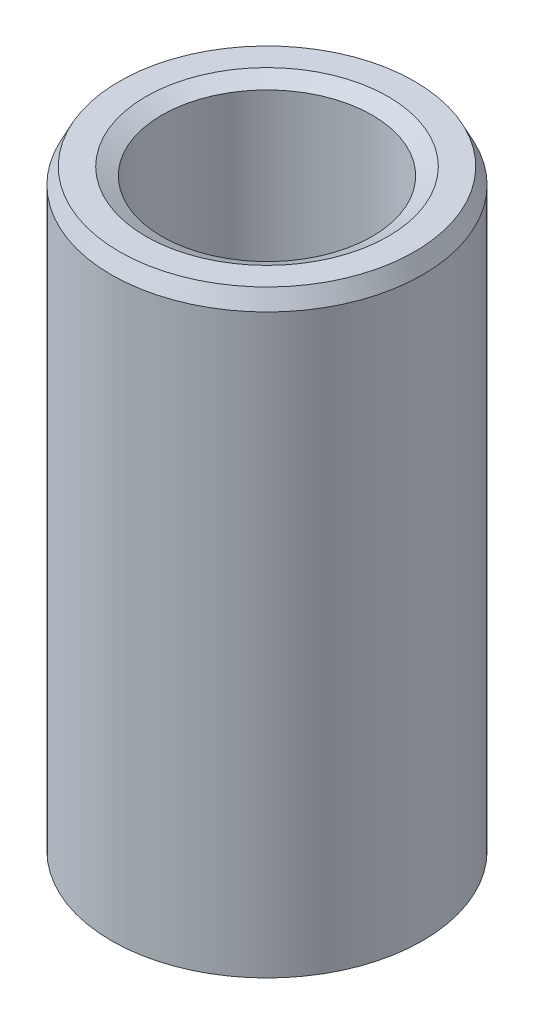
ISO-10303-21;
HEADER;
FILE_DESCRIPTION(('STEP AP214'),'2;1');
FILE_NAME('part.step','',(''),(''),'','','');
FILE_SCHEMA(('AUTOMOTIVE_DESIGN { 1 0 10303 214 1 1 1 1 }'));
ENDSEC;
DATA;
#1=APPLICATION_CONTEXT('core data for automotive mechanical design processes');
#2=APPLICATION_PROTOCOL_DEFINITION('international standard','automotive_design',2000,#1);
#3=PRODUCT_CONTEXT('',#1,'mechanical');
#4=PRODUCT('Part','Part','',(#3));
#5=PRODUCT_RELATED_PRODUCT_CATEGORY('part','',(#4));
#6=PRODUCT_DEFINITION_FORMATION('','',#4);
#7=PRODUCT_DEFINITION_CONTEXT('part definition',#1,'design');
#8=PRODUCT_DEFINITION('design','',#6,#7);
#9=PRODUCT_DEFINITION_SHAPE('','',#8);
#10=(LENGTH_UNIT() NAMED_UNIT(*) SI_UNIT(.MILLI.,.METRE.));
#11=(NAMED_UNIT(*) PLANE_ANGLE_UNIT() SI_UNIT($,.RADIAN.));
#12=(NAMED_UNIT(*) SI_UNIT($,.STERADIAN.) SOLID_ANGLE_UNIT());
#13=UNCERTAINTY_MEASURE_WITH_UNIT(LENGTH_MEASURE(1.E-05),#10,'distance_accuracy_value','');
#14=(GEOMETRIC_REPRESENTATION_CONTEXT(3) GLOBAL_UNCERTAINTY_ASSIGNED_CONTEXT((#13)) GLOBAL_UNIT_ASSIGNED_CONTEXT((#10,
#11,#12)) REPRESENTATION_CONTEXT('',''));
#15=CARTESIAN_POINT('',(0.,0.,0.));
#16=DIRECTION('',(0.,0.,1.));
#17=DIRECTION('',(1.,0.,0.));
#18=AXIS2_PLACEMENT_3D('',#15,#16,#17);
#19=CARTESIAN_POINT('',(0.,57.9000556438181,0.));
#20=DIRECTION('',(0.,-1.,0.));
#21=DIRECTION('',(0.,0.,-1.));
#22=AXIS2_PLACEMENT_3D('',#19,#20,#21);
#23=CYLINDRICAL_SURFACE('',#22,15.);
#24=CARTESIAN_POINT('',(0.,0.773980148250163,0.));
#25=DIRECTION('',(0.,1.,0.));
#26=DIRECTION('',(0.,0.,1.));
#27=AXIS2_PLACEMENT_3D('',#24,#25,#26);
#28=CIRCLE('',#27,15.);
#29=CARTESIAN_POINT('',(0.,0.773980148250163,-15.));
#30=VERTEX_POINT('',#29);
#31=EDGE_CURVE('E10',#30,#30,#28,.T.);
#32=CARTESIAN_POINT('',(0.,56.3586932882017,0.));
#33=DIRECTION('',(0.,1.,0.));
#34=DIRECTION('',(0.,0.,1.));
#35=AXIS2_PLACEMENT_3D('',#32,#33,#34);
#36=CIRCLE('',#35,15.);
#37=CARTESIAN_POINT('',(0.,56.3586932882017,-15.));
#38=VERTEX_POINT('',#37);
#39=EDGE_CURVE('E50',#38,#38,#36,.F.);
#40=CARTESIAN_POINT('',(0.,0.773980148250163,-15.));
#41=CARTESIAN_POINT('',(0.,1.35298757679132,-15.));
#42=CARTESIAN_POINT('',(0.,1.93199500533249,-15.));
#43=CARTESIAN_POINT('',(0.,3.09000986241481,-15.));
#44=CARTESIAN_POINT('',(0.,3.66901729095597,-15.));
#45=CARTESIAN_POINT('',(0.,4.82703214803829,-15.));
#46=CARTESIAN_POINT('',(0.,5.40603957657946,-15.));
#47=CARTESIAN_POINT('',(0.,6.56405443366178,-15.));
#48=CARTESIAN_POINT('',(0.,7.14306186220294,-15.));
#49=CARTESIAN_POINT('',(0.,8.30107671928527,-15.));
#50=CARTESIAN_POINT('',(0.,8.88008414782643,-15.));
#51=CARTESIAN_POINT('',(0.,10.0380990049087,-15.));
#52=CARTESIAN_POINT('',(0.,10.6171064334499,-15.));
#53=CARTESIAN_POINT('',(0.,11.7751212905322,-15.));
#54=CARTESIAN_POINT('',(0.,12.3541287190734,-15.));
#55=CARTESIAN_POINT('',(0.,13.5121435761557,-15.));
#56=CARTESIAN_POINT('',(0.,14.0911510046969,-15.));
#57=CARTESIAN_POINT('',(0.,15.2491658617792,-15.));
#58=CARTESIAN_POINT('',(0.,15.8281732903204,-15.));
#59=CARTESIAN_POINT('',(0.,16.9861881474027,-15.));
#60=CARTESIAN_POINT('',(0.,17.5651955759439,-15.));
#61=CARTESIAN_POINT('',(0.,18.7232104330262,-15.));
#62=CARTESIAN_POINT('',(0.,19.3022178615673,-15.));
#63=CARTESIAN_POINT('',(0.,20.4602327186497,-15.));
#64=CARTESIAN_POINT('',(0.,21.0392401471908,-15.));
#65=CARTESIAN_POINT('',(0.,22.1972550042732,-15.));
#66=CARTESIAN_POINT('',(0.,22.7762624328143,-15.));
#67=CARTESIAN_POINT('',(0.,23.9342772898966,-15.));
#68=CARTESIAN_POINT('',(0.,24.5132847184378,-15.));
#69=CARTESIAN_POINT('',(0.,25.6712995755201,-15.));
#70=CARTESIAN_POINT('',(0.,26.2503070040613,-15.));
#71=CARTESIAN_POINT('',(0.,27.4083218611436,-15.));
#72=CARTESIAN_POINT('',(0.,27.9873292896848,-15.));
#73=CARTESIAN_POINT('',(0.,29.1453441467671,-15.));
#74=CARTESIAN_POINT('',(0.,29.7243515753083,-15.));
#75=CARTESIAN_POINT('',(0.,30.8823664323906,-15.));
#76=CARTESIAN_POINT('',(0.,31.4613738609317,-15.));
#77=CARTESIAN_POINT('',(0.,32.6193887180141,-15.));
#78=CARTESIAN_POINT('',(0.,33.1983961465552,-15.));
#79=CARTESIAN_POINT('',(0.,34.3564110036375,-15.));
#80=CARTESIAN_POINT('',(0.,34.9354184321787,-15.));
#81=CARTESIAN_POINT('',(0.,36.093433289261,-15.));
#82=CARTESIAN_POINT('',(0.,36.6724407178022,-15.));
#83=CARTESIAN_POINT('',(0.,37.8304555748845,-15.));
#84=CARTESIAN_POINT('',(0.,38.4094630034257,-15.));
#85=CARTESIAN_POINT('',(0.,39.567477860508,-15.));
#86=CARTESIAN_POINT('',(0.,40.1464852890492,-15.));
#87=CARTESIAN_POINT('',(0.,41.3045001461315,-15.));
#88=CARTESIAN_POINT('',(0.,41.8835075746726,-15.));
#89=CARTESIAN_POINT('',(0.,43.041522431755,-15.));
#90=CARTESIAN_POINT('',(0.,43.6205298602961,-15.));
#91=CARTESIAN_POINT('',(0.,44.7785447173785,-15.));
#92=CARTESIAN_POINT('',(0.,45.3575521459196,-15.));
#93=CARTESIAN_POINT('',(0.,46.5155670030019,-15.));
#94=CARTESIAN_POINT('',(0.,47.0945744315431,-15.));
#95=CARTESIAN_POINT('',(0.,48.2525892886254,-15.));
#96=CARTESIAN_POINT('',(0.,48.8315967171666,-15.));
#97=CARTESIAN_POINT('',(0.,49.9896115742489,-15.));
#98=CARTESIAN_POINT('',(0.,50.5686190027901,-15.));
#99=CARTESIAN_POINT('',(0.,51.7266338598724,-15.));
#100=CARTESIAN_POINT('',(0.,52.3056412884136,-15.));
#101=CARTESIAN_POINT('',(0.,53.4636561454959,-15.));
#102=CARTESIAN_POINT('',(0.,54.0426635740371,-15.));
#103=CARTESIAN_POINT('',(0.,55.2006784311194,-15.));
#104=CARTESIAN_POINT('',(0.,55.7796858596605,-15.));
#105=CARTESIAN_POINT('',(0.,56.3586932882017,-15.));
#106=B_SPLINE_CURVE_WITH_KNOTS('',3,(#40,#41,#42,#43,#44,#45,#46,#47,#48,#49,#50,#51,#52,#53,
#54,#55,#56,#57,#58,#59,#60,#61,#62,#63,#64,#65,#66,#67,#68,#69,#70,#71,#72,#73,#74,#75,#76,#77,
#78,#79,#80,#81,#82,#83,#84,#85,#86,#87,#88,#89,#90,#91,#92,#93,#94,#95,#96,#97,#98,#99,#100,
#101,#102,#103,#104,#105),.UNSPECIFIED.,.F.,.F.,(4,2,2,2,2,2,2,2,2,2,2,2,2,2,2,2,2,2,2,2,2,2,2,
2,2,2,2,2,2,2,2,2,4),(0.,1.73702228562349,3.47404457124697,5.21106685687046,6.94808914249395,
8.68511142811743,10.4221337137409,12.1591559993644,13.8961782849879,15.6332005706114,
17.3702228562349,19.1072451418583,20.8442674274818,22.5812897131053,24.3183119987288,
26.0553342843523,27.7923565699758,29.5293788555993,31.2664011412227,33.0034234268462,
34.7404457124697,36.4774679980932,38.2144902837167,39.9515125693402,41.6885348549636,
43.4255571405871,45.1625794262106,46.8996017118341,48.6366239974576,50.3736462830811,
52.1106685687046,53.8476908543281,55.5847131399515),.UNSPECIFIED.);
#107=EDGE_CURVE('BSEAM39',#30,#38,#106,.T.);
#108=ORIENTED_EDGE('',*,*,#31,.T.);
#109=ORIENTED_EDGE('',*,*,#39,.T.);
#110=ORIENTED_EDGE('',*,*,#107,.T.);
#111=ORIENTED_EDGE('',*,*,#107,.F.);
#112=EDGE_LOOP('',(#108,#110,#109,#111));
#113=FACE_BOUND('',#112,.T.);
#114=ADVANCED_FACE('F39',(#113),#23,.T.);
#115=CARTESIAN_POINT('',(0.,57.9000556438181,0.));
#116=DIRECTION('',(0.,1.,0.));
#117=DIRECTION('',(0.,0.,1.));
#118=AXIS2_PLACEMENT_3D('',#115,#116,#117);
#119=PLANE('',#118);
#120=CARTESIAN_POINT('',(0.,57.9000556438181,0.));
#121=DIRECTION('',(0.,1.,0.));
#122=DIRECTION('',(0.,0.,1.));
#123=AXIS2_PLACEMENT_3D('',#120,#121,#122);
#124=CIRCLE('',#123,11.6763154670359);
#125=CARTESIAN_POINT('',(0.,57.9000556438181,11.6763154670359));
#126=VERTEX_POINT('',#125);
#127=EDGE_CURVE('E58',#126,#126,#124,.F.);
#128=ORIENTED_EDGE('',*,*,#127,.T.);
#129=EDGE_LOOP('',(#128));
#130=FACE_BOUND('',#129,.T.);
#131=CARTESIAN_POINT('',(0.,57.9000556438181,0.));
#132=DIRECTION('',(0.,1.,0.));
#133=DIRECTION('',(0.,0.,1.));
#134=AXIS2_PLACEMENT_3D('',#131,#132,#133);
#135=CIRCLE('',#134,14.2260198517499);
#136=CARTESIAN_POINT('',(0.,57.9000556438181,-14.2260198517499));
#137=VERTEX_POINT('',#136);
#138=EDGE_CURVE('E61',#137,#137,#135,.T.);
#139=ORIENTED_EDGE('',*,*,#138,.T.);
#140=EDGE_LOOP('',(#139));
#141=FACE_BOUND('',#140,.T.);
#142=ADVANCED_FACE('F88',(#130,#141),#119,.T.);
#143=CARTESIAN_POINT('',(0.,0.,0.));
#144=DIRECTION('',(0.,1.,0.));
#145=DIRECTION('',(0.,0.,1.));
#146=AXIS2_PLACEMENT_3D('',#143,#144,#145);
#147=PLANE('',#146);
#148=CARTESIAN_POINT('',(0.,0.,0.));
#149=DIRECTION('',(0.,1.,0.));
#150=DIRECTION('',(0.,0.,1.));
#151=AXIS2_PLACEMENT_3D('',#148,#149,#150);
#152=CIRCLE('',#151,10.9089332596696);
#153=CARTESIAN_POINT('',(0.,0.,10.9089332596696));
#154=VERTEX_POINT('',#153);
#155=EDGE_CURVE('E51',#154,#154,#152,.T.);
#156=ORIENTED_EDGE('',*,*,#155,.T.);
#157=EDGE_LOOP('',(#156));
#158=FACE_BOUND('',#157,.T.);
#159=CARTESIAN_POINT('',(0.,0.,0.));
#160=DIRECTION('',(0.,1.,0.));
#161=DIRECTION('',(0.,0.,1.));
#162=AXIS2_PLACEMENT_3D('',#159,#160,#161);
#163=CIRCLE('',#162,13.4586376443836);
#164=CARTESIAN_POINT('',(0.,0.,13.4586376443836));
#165=VERTEX_POINT('',#164);
#166=EDGE_CURVE('E54',#165,#165,#163,.F.);
#167=ORIENTED_EDGE('',*,*,#166,.T.);
#168=EDGE_LOOP('',(#167));
#169=FACE_BOUND('',#168,.T.);
#170=ADVANCED_FACE('F83',(#158,#169),#147,.F.);
#171=CARTESIAN_POINT('',(0.,57.9000556438181,0.));
#172=DIRECTION('',(0.,-1.,0.));
#173=DIRECTION('',(0.,0.,-1.));
#174=AXIS2_PLACEMENT_3D('',#171,#172,#173);
#175=CYLINDRICAL_SURFACE('',#174,10.1349531114194);
#176=CARTESIAN_POINT('',(0.,57.1260754955679,0.));
#177=DIRECTION('',(0.,1.,0.));
#178=DIRECTION('',(0.,0.,1.));
#179=AXIS2_PLACEMENT_3D('',#176,#177,#178);
#180=CIRCLE('',#179,10.1349531114194);
#181=CARTESIAN_POINT('',(0.,57.1260754955679,-10.1349531114194));
#182=VERTEX_POINT('',#181);
#183=EDGE_CURVE('E67',#182,#182,#180,.T.);
#184=CARTESIAN_POINT('',(0.,1.54136235561642,0.));
#185=DIRECTION('',(0.,1.,0.));
#186=DIRECTION('',(0.,0.,1.));
#187=AXIS2_PLACEMENT_3D('',#184,#185,#186);
#188=CIRCLE('',#187,10.1349531114194);
#189=CARTESIAN_POINT('',(0.,1.54136235561641,-10.1349531114194));
#190=VERTEX_POINT('',#189);
#191=EDGE_CURVE('E69',#190,#190,#188,.F.);
#192=CARTESIAN_POINT('',(0.,57.1260754955679,-10.1349531114194));
#193=CARTESIAN_POINT('',(0.,56.5470680670268,-10.1349531114194));
#194=CARTESIAN_POINT('',(0.,55.9680606384856,-10.1349531114194));
#195=CARTESIAN_POINT('',(0.,54.8100457814033,-10.1349531114194));
#196=CARTESIAN_POINT('',(0.,54.2310383528621,-10.1349531114194));
#197=CARTESIAN_POINT('',(0.,53.0730234957798,-10.1349531114194));
#198=CARTESIAN_POINT('',(0.,52.4940160672386,-10.1349531114194));
#199=CARTESIAN_POINT('',(0.,51.3360012101563,-10.1349531114194));
#200=CARTESIAN_POINT('',(0.,50.7569937816151,-10.1349531114194));
#201=CARTESIAN_POINT('',(0.,49.5989789245328,-10.1349531114194));
#202=CARTESIAN_POINT('',(0.,49.0199714959917,-10.1349531114194));
#203=CARTESIAN_POINT('',(0.,47.8619566389093,-10.1349531114194));
#204=CARTESIAN_POINT('',(0.,47.2829492103682,-10.1349531114194));
#205=CARTESIAN_POINT('',(0.,46.1249343532859,-10.1349531114194));
#206=CARTESIAN_POINT('',(0.,45.5459269247447,-10.1349531114194));
#207=CARTESIAN_POINT('',(0.,44.3879120676624,-10.1349531114194));
#208=CARTESIAN_POINT('',(0.,43.8089046391212,-10.1349531114194));
#209=CARTESIAN_POINT('',(0.,42.6508897820389,-10.1349531114194));
#210=CARTESIAN_POINT('',(0.,42.0718823534977,-10.1349531114194));
#211=CARTESIAN_POINT('',(0.,40.9138674964154,-10.1349531114194));
#212=CARTESIAN_POINT('',(0.,40.3348600678742,-10.1349531114194));
#213=CARTESIAN_POINT('',(0.,39.1768452107919,-10.1349531114194));
#214=CARTESIAN_POINT('',(0.,38.5978377822507,-10.1349531114194));
#215=CARTESIAN_POINT('',(0.,37.4398229251684,-10.1349531114194));
#216=CARTESIAN_POINT('',(0.,36.8608154966273,-10.1349531114194));
#217=CARTESIAN_POINT('',(0.,35.7028006395449,-10.1349531114194));
#218=CARTESIAN_POINT('',(0.,35.1237932110038,-10.1349531114194));
#219=CARTESIAN_POINT('',(0.,33.9657783539215,-10.1349531114194));
#220=CARTESIAN_POINT('',(0.,33.3867709253803,-10.1349531114194));
#221=CARTESIAN_POINT('',(0.,32.228756068298,-10.1349531114194));
#222=CARTESIAN_POINT('',(0.,31.6497486397568,-10.1349531114194));
#223=CARTESIAN_POINT('',(0.,30.4917337826745,-10.1349531114194));
#224=CARTESIAN_POINT('',(0.,29.9127263541333,-10.1349531114194));
#225=CARTESIAN_POINT('',(0.,28.754711497051,-10.1349531114194));
#226=CARTESIAN_POINT('',(0.,28.1757040685098,-10.1349531114194));
#227=CARTESIAN_POINT('',(0.,27.0176892114275,-10.1349531114194));
#228=CARTESIAN_POINT('',(0.,26.4386817828864,-10.1349531114194));
#229=CARTESIAN_POINT('',(0.,25.280666925804,-10.1349531114194));
#230=CARTESIAN_POINT('',(0.,24.7016594972629,-10.1349531114194));
#231=CARTESIAN_POINT('',(0.,23.5436446401806,-10.1349531114194));
#232=CARTESIAN_POINT('',(0.,22.9646372116394,-10.1349531114194));
#233=CARTESIAN_POINT('',(0.,21.8066223545571,-10.1349531114194));
#234=CARTESIAN_POINT('',(0.,21.2276149260159,-10.1349531114194));
#235=CARTESIAN_POINT('',(0.,20.0696000689336,-10.1349531114194));
#236=CARTESIAN_POINT('',(0.,19.4905926403924,-10.1349531114194));
#237=CARTESIAN_POINT('',(0.,18.3325777833101,-10.1349531114194));
#238=CARTESIAN_POINT('',(0.,17.7535703547689,-10.1349531114194));
#239=CARTESIAN_POINT('',(0.,16.5955554976866,-10.1349531114194));
#240=CARTESIAN_POINT('',(0.,16.0165480691454,-10.1349531114194));
#241=CARTESIAN_POINT('',(0.,14.8585332120631,-10.1349531114194));
#242=CARTESIAN_POINT('',(0.,14.279525783522,-10.1349531114194));
#243=CARTESIAN_POINT('',(0.,13.1215109264396,-10.1349531114194));
#244=CARTESIAN_POINT('',(0.,12.5425034978985,-10.1349531114194));
#245=CARTESIAN_POINT('',(0.,11.3844886408162,-10.1349531114194));
#246=CARTESIAN_POINT('',(0.,10.805481212275,-10.1349531114194));
#247=CARTESIAN_POINT('',(0.,9.64746635519267,-10.1349531114194));
#248=CARTESIAN_POINT('',(0.,9.06845892665151,-10.1349531114194));
#249=CARTESIAN_POINT('',(0.,7.91044406956919,-10.1349531114194));
#250=CARTESIAN_POINT('',(0.,7.33143664102803,-10.1349531114194));
#251=CARTESIAN_POINT('',(0.,6.17342178394571,-10.1349531114194));
#252=CARTESIAN_POINT('',(0.,5.59441435540455,-10.1349531114194));
#253=CARTESIAN_POINT('',(0.,4.43639949832222,-10.1349531114194));
#254=CARTESIAN_POINT('',(0.,3.85739206978106,-10.1349531114194));
#255=CARTESIAN_POINT('',(0.,2.69937721269873,-10.1349531114194));
#256=CARTESIAN_POINT('',(0.,2.12036978415757,-10.1349531114194));
#257=CARTESIAN_POINT('',(0.,1.54136235561641,-10.1349531114194));
#258=B_SPLINE_CURVE_WITH_KNOTS('',3,(#192,#193,#194,#195,#196,#197,#198,#199,#200,#201,#202,
#203,#204,#205,#206,#207,#208,#209,#210,#211,#212,#213,#214,#215,#216,#217,#218,#219,#220,#221,
#222,#223,#224,#225,#226,#227,#228,#229,#230,#231,#232,#233,#234,#235,#236,#237,#238,#239,#240,
#241,#242,#243,#244,#245,#246,#247,#248,#249,#250,#251,#252,#253,#254,#255,#256,#257),
.UNSPECIFIED.,.F.,.F.,(4,2,2,2,2,2,2,2,2,2,2,2,2,2,2,2,2,2,2,2,2,2,2,2,2,2,2,2,2,2,2,2,4),(0.,
1.73702228562349,3.47404457124697,5.21106685687046,6.94808914249395,8.68511142811743,
10.4221337137409,12.1591559993644,13.8961782849879,15.6332005706114,17.3702228562348,
19.1072451418583,20.8442674274818,22.5812897131053,24.3183119987288,26.0553342843523,
27.7923565699758,29.5293788555992,31.2664011412227,33.0034234268462,34.7404457124697,
36.4774679980932,38.2144902837167,39.9515125693402,41.6885348549636,43.4255571405871,
45.1625794262106,46.8996017118341,48.6366239974576,50.3736462830811,52.1106685687045,
53.847690854328,55.5847131399515),.UNSPECIFIED.);
#259=EDGE_CURVE('BSEAM71',#182,#190,#258,.T.);
#260=ORIENTED_EDGE('',*,*,#183,.T.);
#261=ORIENTED_EDGE('',*,*,#191,.T.);
#262=ORIENTED_EDGE('',*,*,#259,.T.);
#263=ORIENTED_EDGE('',*,*,#259,.F.);
#264=EDGE_LOOP('',(#260,#262,#261,#263));
#265=FACE_BOUND('',#264,.T.);
#266=ADVANCED_FACE('F71',(#265),#175,.F.);
#267=CARTESIAN_POINT('',(0.,57.1260754955679,0.));
#268=DIRECTION('',(0.,1.,0.));
#269=DIRECTION('',(0.,0.,1.));
#270=AXIS2_PLACEMENT_3D('',#267,#268,#269);
#271=CONICAL_SURFACE('',#270,10.1349531114194,1.10543794793032);
#272=ORIENTED_EDGE('',*,*,#127,.F.);
#273=EDGE_LOOP('',(#272));
#274=FACE_BOUND('',#273,.T.);
#275=ORIENTED_EDGE('',*,*,#183,.F.);
#276=EDGE_LOOP('',(#275));
#277=FACE_BOUND('',#276,.T.);
#278=ADVANCED_FACE('F77',(#274,#277),#271,.F.);
#279=CARTESIAN_POINT('',(0.,0.,0.));
#280=DIRECTION('',(0.,-1.,0.));
#281=DIRECTION('',(0.,0.,-1.));
#282=AXIS2_PLACEMENT_3D('',#279,#280,#281);
#283=CONICAL_SURFACE('',#282,10.9089332596696,0.465358378864579);
#284=ORIENTED_EDGE('',*,*,#191,.F.);
#285=EDGE_LOOP('',(#284));
#286=FACE_BOUND('',#285,.T.);
#287=ORIENTED_EDGE('',*,*,#155,.F.);
#288=EDGE_LOOP('',(#287));
#289=FACE_BOUND('',#288,.T.);
#290=ADVANCED_FACE('F73',(#286,#289),#283,.F.);
#291=CARTESIAN_POINT('',(0.,0.773980148250163,0.));
#292=DIRECTION('',(0.,1.,0.));
#293=DIRECTION('',(0.,0.,1.));
#294=AXIS2_PLACEMENT_3D('',#291,#292,#293);
#295=CONICAL_SURFACE('',#294,15.,1.10543794793032);
#296=ORIENTED_EDGE('',*,*,#166,.F.);
#297=EDGE_LOOP('',(#296));
#298=FACE_BOUND('',#297,.T.);
#299=ORIENTED_EDGE('',*,*,#31,.F.);
#300=EDGE_LOOP('',(#299));
#301=FACE_BOUND('',#300,.T.);
#302=ADVANCED_FACE('F76',(#298,#301),#295,.T.);
#303=CARTESIAN_POINT('',(0.,57.9000556438181,0.));
#304=DIRECTION('',(0.,-1.,0.));
#305=DIRECTION('',(0.,0.,-1.));
#306=AXIS2_PLACEMENT_3D('',#303,#304,#305);
#307=CONICAL_SURFACE('',#306,14.2260198517499,0.465358378864579);
#308=CARTESIAN_POINT('',(0.,56.3586932882017,-15.));
#309=CARTESIAN_POINT('',(0.,56.3747491460727,-14.9919377067891));
#310=CARTESIAN_POINT('',(0.,56.3908050039437,-14.9838754135781));
#311=CARTESIAN_POINT('',(0.,56.4229167196857,-14.9677508271562));
#312=CARTESIAN_POINT('',(0.,56.4389725775567,-14.9596885339453));
#313=CARTESIAN_POINT('',(0.,56.4710842932987,-14.9435639475234));
#314=CARTESIAN_POINT('',(0.,56.4871401511697,-14.9355016543125));
#315=CARTESIAN_POINT('',(0.,56.5192518669117,-14.9193770678906));
#316=CARTESIAN_POINT('',(0.,56.5353077247827,-14.9113147746797));
#317=CARTESIAN_POINT('',(0.,56.5674194405248,-14.8951901882578));
#318=CARTESIAN_POINT('',(0.,56.5834752983958,-14.8871278950469));
#319=CARTESIAN_POINT('',(0.,56.6155870141378,-14.871003308625));
#320=CARTESIAN_POINT('',(0.,56.6316428720088,-14.862941015414));
#321=CARTESIAN_POINT('',(0.,56.6637545877508,-14.8468164289922));
#322=CARTESIAN_POINT('',(0.,56.6798104456218,-14.8387541357812));
#323=CARTESIAN_POINT('',(0.,56.7119221613638,-14.8226295493593));
#324=CARTESIAN_POINT('',(0.,56.7279780192348,-14.8145672561484));
#325=CARTESIAN_POINT('',(0.,56.7600897349768,-14.7984426697265));
#326=CARTESIAN_POINT('',(0.,56.7761455928478,-14.7903803765156));
#327=CARTESIAN_POINT('',(0.,56.8082573085898,-14.7742557900937));
#328=CARTESIAN_POINT('',(0.,56.8243131664608,-14.7661934968828));
#329=CARTESIAN_POINT('',(0.,56.8564248822028,-14.7500689104609));
#330=CARTESIAN_POINT('',(0.,56.8724807400738,-14.74200661725));
#331=CARTESIAN_POINT('',(0.,56.9045924558158,-14.7258820308281));
#332=CARTESIAN_POINT('',(0.,56.9206483136868,-14.7178197376171));
#333=CARTESIAN_POINT('',(0.,56.9527600294288,-14.7016951511953));
#334=CARTESIAN_POINT('',(0.,56.9688158872999,-14.6936328579843));
#335=CARTESIAN_POINT('',(0.,57.0009276030419,-14.6775082715625));
#336=CARTESIAN_POINT('',(0.,57.0169834609129,-14.6694459783515));
#337=CARTESIAN_POINT('',(0.,57.0490951766549,-14.6533213919296));
#338=CARTESIAN_POINT('',(0.,57.0651510345259,-14.6452590987187));
#339=CARTESIAN_POINT('',(0.,57.0972627502679,-14.6291345122968));
#340=CARTESIAN_POINT('',(0.,57.1133186081389,-14.6210722190859));
#341=CARTESIAN_POINT('',(0.,57.1454303238809,-14.604947632664));
#342=CARTESIAN_POINT('',(0.,57.1614861817519,-14.5968853394531));
#343=CARTESIAN_POINT('',(0.,57.1935978974939,-14.5807607530312));
#344=CARTESIAN_POINT('',(0.,57.2096537553649,-14.5726984598202));
#345=CARTESIAN_POINT('',(0.,57.2417654711069,-14.5565738733984));
#346=CARTESIAN_POINT('',(0.,57.2578213289779,-14.5485115801874));
#347=CARTESIAN_POINT('',(0.,57.2899330447199,-14.5323869937656));
#348=CARTESIAN_POINT('',(0.,57.3059889025909,-14.5243247005546));
#349=CARTESIAN_POINT('',(0.,57.3381006183329,-14.5082001141327));
#350=CARTESIAN_POINT('',(0.,57.3541564762039,-14.5001378209218));
#351=CARTESIAN_POINT('',(0.,57.386268191946,-14.4840132344999));
#352=CARTESIAN_POINT('',(0.,57.402324049817,-14.475950941289));
#353=CARTESIAN_POINT('',(0.,57.434435765559,-14.4598263548671));
#354=CARTESIAN_POINT('',(0.,57.45049162343,-14.4517640616562));
#355=CARTESIAN_POINT('',(0.,57.482603339172,-14.4356394752343));
#356=CARTESIAN_POINT('',(0.,57.498659197043,-14.4275771820234));
#357=CARTESIAN_POINT('',(0.,57.530770912785,-14.4114525956015));
#358=CARTESIAN_POINT('',(0.,57.546826770656,-14.4033903023905));
#359=CARTESIAN_POINT('',(0.,57.578938486398,-14.3872657159687));
#360=CARTESIAN_POINT('',(0.,57.594994344269,-14.3792034227577));
#361=CARTESIAN_POINT('',(0.,57.627106060011,-14.3630788363358));
#362=CARTESIAN_POINT('',(0.,57.643161917882,-14.3550165431249));
#363=CARTESIAN_POINT('',(0.,57.675273633624,-14.338891956703));
#364=CARTESIAN_POINT('',(0.,57.691329491495,-14.3308296634921));
#365=CARTESIAN_POINT('',(0.,57.723441207237,-14.3147050770702));
#366=CARTESIAN_POINT('',(0.,57.739497065108,-14.3066427838593));
#367=CARTESIAN_POINT('',(0.,57.77160878085,-14.2905181974374));
#368=CARTESIAN_POINT('',(0.,57.787664638721,-14.2824559042265));
#369=CARTESIAN_POINT('',(0.,57.8197763544631,-14.2663313178046));
#370=CARTESIAN_POINT('',(0.,57.8358322123341,-14.2582690245936));
#371=CARTESIAN_POINT('',(0.,57.8679439280761,-14.2421444381718));
#372=CARTESIAN_POINT('',(0.,57.8839997859471,-14.2340821449608));
#373=CARTESIAN_POINT('',(0.,57.9000556438181,-14.2260198517499));
#374=B_SPLINE_CURVE_WITH_KNOTS('',3,(#308,#309,#310,#311,#312,#313,#314,#315,#316,#317,#318,
#319,#320,#321,#322,#323,#324,#325,#326,#327,#328,#329,#330,#331,#332,#333,#334,#335,#336,#337,
#338,#339,#340,#341,#342,#343,#344,#345,#346,#347,#348,#349,#350,#351,#352,#353,#354,#355,#356,
#357,#358,#359,#360,#361,#362,#363,#364,#365,#366,#367,#368,#369,#370,#371,#372,#373),
.UNSPECIFIED.,.F.,.F.,(4,2,2,2,2,2,2,2,2,2,2,2,2,2,2,2,2,2,2,2,2,2,2,2,2,2,2,2,2,2,2,2,4),(0.,
0.053899167842711,0.107798335685427,0.161697503528145,0.215596671370862,0.269495839213572,
0.323395007056289,0.377294174899006,0.431193342741723,0.48509251058444,0.53899167842715,
0.592890846269868,0.646790014112584,0.700689181955301,0.754588349798012,0.808487517640729,
0.862386685483446,0.916285853326163,0.97018502116888,1.02408418901159,1.07798335685431,
1.13188252469702,1.18578169253974,1.23968086038245,1.29358002822517,1.34747919606789,
1.4013783639106,1.45527753175332,1.50917669959603,1.56307586743875,1.61697503528146,
1.67087420312418,1.7247733709669),.UNSPECIFIED.);
#375=EDGE_CURVE('BSEAM45',#38,#137,#374,.T.);
#376=ORIENTED_EDGE('',*,*,#39,.F.);
#377=ORIENTED_EDGE('',*,*,#138,.F.);
#378=ORIENTED_EDGE('',*,*,#375,.T.);
#379=ORIENTED_EDGE('',*,*,#375,.F.);
#380=EDGE_LOOP('',(#376,#378,#377,#379));
#381=FACE_BOUND('',#380,.T.);
#382=ADVANCED_FACE('F45',(#381),#307,.T.);
#383=CLOSED_SHELL('',(#114,#142,#170,#266,#278,#290,#302,#382));
#384=MANIFOLD_SOLID_BREP('B2',#383);
#385=ADVANCED_BREP_SHAPE_REPRESENTATION('',(#18,#384),#14);
#386=SHAPE_DEFINITION_REPRESENTATION(#9,#385);
ENDSEC;
END-ISO-10303-21;
